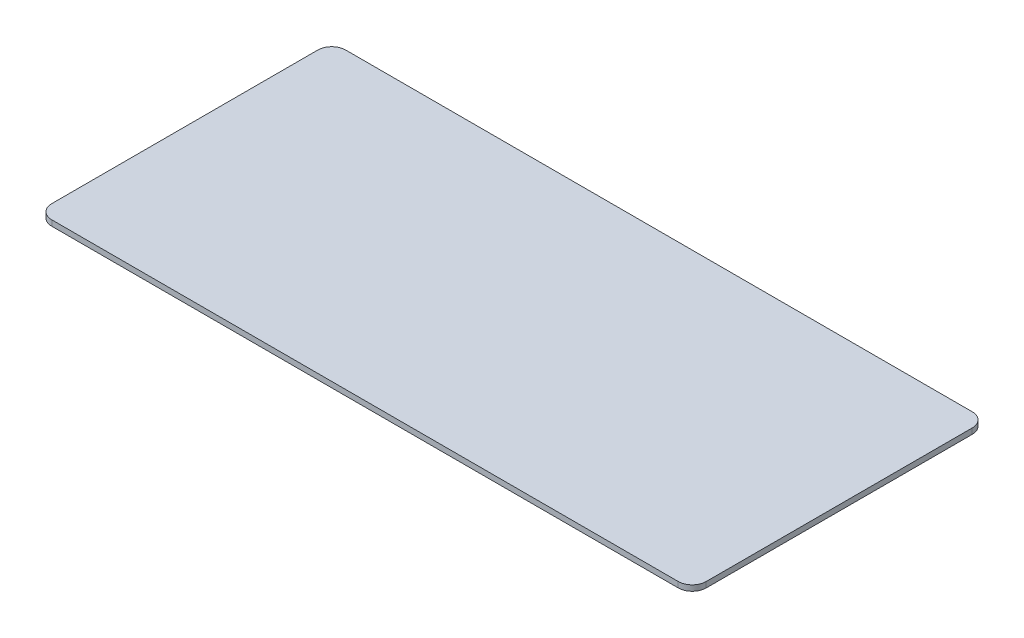
ISO-10303-21;
HEADER;
FILE_DESCRIPTION(('STEP AP214'),'2;1');
FILE_NAME('part.step','',(''),(''),'','','');
FILE_SCHEMA(('AUTOMOTIVE_DESIGN { 1 0 10303 214 1 1 1 1 }'));
ENDSEC;
DATA;
#1=APPLICATION_CONTEXT('core data for automotive mechanical design processes');
#2=APPLICATION_PROTOCOL_DEFINITION('international standard','automotive_design',2000,#1);
#3=PRODUCT_CONTEXT('',#1,'mechanical');
#4=PRODUCT('Part','Part','',(#3));
#5=PRODUCT_RELATED_PRODUCT_CATEGORY('part','',(#4));
#6=PRODUCT_DEFINITION_FORMATION('','',#4);
#7=PRODUCT_DEFINITION_CONTEXT('part definition',#1,'design');
#8=PRODUCT_DEFINITION('design','',#6,#7);
#9=PRODUCT_DEFINITION_SHAPE('','',#8);
#10=(LENGTH_UNIT() NAMED_UNIT(*) SI_UNIT(.MILLI.,.METRE.));
#11=(NAMED_UNIT(*) PLANE_ANGLE_UNIT() SI_UNIT($,.RADIAN.));
#12=(NAMED_UNIT(*) SI_UNIT($,.STERADIAN.) SOLID_ANGLE_UNIT());
#13=UNCERTAINTY_MEASURE_WITH_UNIT(LENGTH_MEASURE(1.E-05),#10,'distance_accuracy_value','');
#14=(GEOMETRIC_REPRESENTATION_CONTEXT(3) GLOBAL_UNCERTAINTY_ASSIGNED_CONTEXT((#13)) GLOBAL_UNIT_ASSIGNED_CONTEXT((#10,
#11,#12)) REPRESENTATION_CONTEXT('',''));
#15=CARTESIAN_POINT('',(0.,0.,0.));
#16=DIRECTION('',(0.,0.,1.));
#17=DIRECTION('',(1.,0.,0.));
#18=AXIS2_PLACEMENT_3D('',#15,#16,#17);
#19=CARTESIAN_POINT('',(18.1569082796088,0.8,33.0600891692419));
#20=DIRECTION('',(0.,-1.,0.));
#21=DIRECTION('',(0.,0.,-1.));
#22=AXIS2_PLACEMENT_3D('',#19,#20,#21);
#23=CYLINDRICAL_SURFACE('',#22,2.);
#24=CARTESIAN_POINT('',(18.1569082796088,0.,33.0600891692419));
#25=DIRECTION('',(0.,1.,0.));
#26=DIRECTION('',(0.,0.,1.));
#27=AXIS2_PLACEMENT_3D('',#24,#25,#26);
#28=CIRCLE('',#27,2.);
#29=CARTESIAN_POINT('',(18.1569082796088,0.,35.0600891692419));
#30=VERTEX_POINT('',#29);
#31=CARTESIAN_POINT('',(20.1569082796088,0.,33.0600891692418));
#32=VERTEX_POINT('',#31);
#33=EDGE_CURVE('E144',#30,#32,#28,.T.);
#34=ORIENTED_EDGE('',*,*,#33,.T.);
#35=DIRECTION('',(0.,-1.,0.));
#36=VECTOR('',#35,1.);
#37=CARTESIAN_POINT('',(20.1569082796088,0.8,33.0600891692418));
#38=LINE('',#37,#36);
#39=CARTESIAN_POINT('',(20.1569082796088,0.8,33.0600891692418));
#40=VERTEX_POINT('',#39);
#41=EDGE_CURVE('E11',#40,#32,#38,.T.);
#42=ORIENTED_EDGE('',*,*,#41,.F.);
#43=CARTESIAN_POINT('',(18.1569082796088,0.8,33.0600891692419));
#44=DIRECTION('',(0.,1.,0.));
#45=DIRECTION('',(0.,0.,1.));
#46=AXIS2_PLACEMENT_3D('',#43,#44,#45);
#47=CIRCLE('',#46,2.);
#48=CARTESIAN_POINT('',(18.1569082796088,0.8,35.0600891692419));
#49=VERTEX_POINT('',#48);
#50=EDGE_CURVE('E166',#49,#40,#47,.T.);
#51=ORIENTED_EDGE('',*,*,#50,.F.);
#52=DIRECTION('',(0.,-1.,0.));
#53=VECTOR('',#52,1.);
#54=CARTESIAN_POINT('',(18.1569082796088,0.8,35.0600891692419));
#55=LINE('',#54,#53);
#56=EDGE_CURVE('E140',#49,#30,#55,.T.);
#57=ORIENTED_EDGE('',*,*,#56,.T.);
#58=EDGE_LOOP('',(#34,#42,#51,#57));
#59=FACE_BOUND('',#58,.T.);
#60=ADVANCED_FACE('F43',(#59),#23,.T.);
#61=CARTESIAN_POINT('',(20.1569082796088,0.8,33.0600891692418));
#62=DIRECTION('',(-1.,0.,0.));
#63=DIRECTION('',(0.,0.,1.));
#64=AXIS2_PLACEMENT_3D('',#61,#62,#63);
#65=PLANE('',#64);
#66=DIRECTION('',(0.,0.,-1.));
#67=VECTOR('',#66,1.);
#68=CARTESIAN_POINT('',(20.1569082796088,0.,33.0600891692418));
#69=LINE('',#68,#67);
#70=CARTESIAN_POINT('',(20.1569082796088,0.,-4.93991083075813));
#71=VERTEX_POINT('',#70);
#72=EDGE_CURVE('E148',#32,#71,#69,.T.);
#73=ORIENTED_EDGE('',*,*,#72,.T.);
#74=DIRECTION('',(0.,-1.,0.));
#75=VECTOR('',#74,1.);
#76=CARTESIAN_POINT('',(20.1569082796088,0.8,-4.93991083075813));
#77=LINE('',#76,#75);
#78=CARTESIAN_POINT('',(20.1569082796088,0.8,-4.93991083075813));
#79=VERTEX_POINT('',#78);
#80=EDGE_CURVE('E52',#79,#71,#77,.T.);
#81=ORIENTED_EDGE('',*,*,#80,.F.);
#82=DIRECTION('',(0.,0.,-1.));
#83=VECTOR('',#82,1.);
#84=CARTESIAN_POINT('',(20.1569082796088,0.8,33.0600891692418));
#85=LINE('',#84,#83);
#86=EDGE_CURVE('E103',#40,#79,#85,.T.);
#87=ORIENTED_EDGE('',*,*,#86,.F.);
#88=ORIENTED_EDGE('',*,*,#41,.T.);
#89=EDGE_LOOP('',(#73,#81,#87,#88));
#90=FACE_BOUND('',#89,.T.);
#91=ADVANCED_FACE('F212',(#90),#65,.F.);
#92=CARTESIAN_POINT('',(18.1569082796088,0.8,-4.93991083075815));
#93=DIRECTION('',(0.,-1.,0.));
#94=DIRECTION('',(0.,0.,-1.));
#95=AXIS2_PLACEMENT_3D('',#92,#93,#94);
#96=CYLINDRICAL_SURFACE('',#95,2.);
#97=CARTESIAN_POINT('',(18.1569082796088,0.,-4.93991083075815));
#98=DIRECTION('',(0.,1.,0.));
#99=DIRECTION('',(0.,0.,-1.));
#100=AXIS2_PLACEMENT_3D('',#97,#98,#99);
#101=CIRCLE('',#100,2.);
#102=CARTESIAN_POINT('',(18.1569082796088,0.,-6.93991083075815));
#103=VERTEX_POINT('',#102);
#104=EDGE_CURVE('E151',#71,#103,#101,.T.);
#105=ORIENTED_EDGE('',*,*,#104,.T.);
#106=DIRECTION('',(0.,-1.,0.));
#107=VECTOR('',#106,1.);
#108=CARTESIAN_POINT('',(18.1569082796088,0.8,-6.93991083075815));
#109=LINE('',#108,#107);
#110=CARTESIAN_POINT('',(18.1569082796088,0.8,-6.93991083075815));
#111=VERTEX_POINT('',#110);
#112=EDGE_CURVE('E177',#111,#103,#109,.T.);
#113=ORIENTED_EDGE('',*,*,#112,.F.);
#114=CARTESIAN_POINT('',(18.1569082796088,0.8,-4.93991083075815));
#115=DIRECTION('',(0.,1.,0.));
#116=DIRECTION('',(0.,0.,-1.));
#117=AXIS2_PLACEMENT_3D('',#114,#115,#116);
#118=CIRCLE('',#117,2.);
#119=EDGE_CURVE('E187',#79,#111,#118,.T.);
#120=ORIENTED_EDGE('',*,*,#119,.F.);
#121=ORIENTED_EDGE('',*,*,#80,.T.);
#122=EDGE_LOOP('',(#105,#113,#120,#121));
#123=FACE_BOUND('',#122,.T.);
#124=ADVANCED_FACE('F185',(#123),#96,.T.);
#125=CARTESIAN_POINT('',(-71.3430917203912,0.8,-6.93991083075815));
#126=DIRECTION('',(0.,0.,1.));
#127=DIRECTION('',(1.,0.,0.));
#128=AXIS2_PLACEMENT_3D('',#125,#126,#127);
#129=PLANE('',#128);
#130=DIRECTION('',(-1.,0.,0.));
#131=VECTOR('',#130,1.);
#132=CARTESIAN_POINT('',(-71.3430917203912,0.,-6.93991083075815));
#133=LINE('',#132,#131);
#134=CARTESIAN_POINT('',(-71.3430917203912,0.,-6.93991083075815));
#135=VERTEX_POINT('',#134);
#136=EDGE_CURVE('E154',#103,#135,#133,.T.);
#137=ORIENTED_EDGE('',*,*,#136,.T.);
#138=DIRECTION('',(0.,-1.,0.));
#139=VECTOR('',#138,1.);
#140=CARTESIAN_POINT('',(-71.3430917203912,0.8,-6.93991083075815));
#141=LINE('',#140,#139);
#142=CARTESIAN_POINT('',(-71.3430917203912,0.8,-6.93991083075815));
#143=VERTEX_POINT('',#142);
#144=EDGE_CURVE('E173',#143,#135,#141,.T.);
#145=ORIENTED_EDGE('',*,*,#144,.F.);
#146=DIRECTION('',(-1.,0.,0.));
#147=VECTOR('',#146,1.);
#148=CARTESIAN_POINT('',(-71.3430917203912,0.8,-6.93991083075815));
#149=LINE('',#148,#147);
#150=EDGE_CURVE('E200',#111,#143,#149,.T.);
#151=ORIENTED_EDGE('',*,*,#150,.F.);
#152=ORIENTED_EDGE('',*,*,#112,.T.);
#153=EDGE_LOOP('',(#137,#145,#151,#152));
#154=FACE_BOUND('',#153,.T.);
#155=ADVANCED_FACE('F195',(#154),#129,.F.);
#156=CARTESIAN_POINT('',(-71.3430917203912,0.8,-4.93991083075815));
#157=DIRECTION('',(0.,-1.,0.));
#158=DIRECTION('',(0.,0.,-1.));
#159=AXIS2_PLACEMENT_3D('',#156,#157,#158);
#160=CYLINDRICAL_SURFACE('',#159,2.);
#161=CARTESIAN_POINT('',(-71.3430917203912,0.,-4.93991083075815));
#162=DIRECTION('',(0.,1.,0.));
#163=DIRECTION('',(0.,0.,-1.));
#164=AXIS2_PLACEMENT_3D('',#161,#162,#163);
#165=CIRCLE('',#164,2.);
#166=CARTESIAN_POINT('',(-73.3430917203912,0.,-4.93991083075813));
#167=VERTEX_POINT('',#166);
#168=EDGE_CURVE('E157',#135,#167,#165,.T.);
#169=ORIENTED_EDGE('',*,*,#168,.T.);
#170=DIRECTION('',(0.,-1.,0.));
#171=VECTOR('',#170,1.);
#172=CARTESIAN_POINT('',(-73.3430917203912,0.8,-4.93991083075813));
#173=LINE('',#172,#171);
#174=CARTESIAN_POINT('',(-73.3430917203912,0.8,-4.93991083075813));
#175=VERTEX_POINT('',#174);
#176=EDGE_CURVE('E133',#175,#167,#173,.T.);
#177=ORIENTED_EDGE('',*,*,#176,.F.);
#178=CARTESIAN_POINT('',(-71.3430917203912,0.8,-4.93991083075815));
#179=DIRECTION('',(0.,1.,0.));
#180=DIRECTION('',(0.,0.,-1.));
#181=AXIS2_PLACEMENT_3D('',#178,#179,#180);
#182=CIRCLE('',#181,2.);
#183=EDGE_CURVE('E122',#143,#175,#182,.T.);
#184=ORIENTED_EDGE('',*,*,#183,.F.);
#185=ORIENTED_EDGE('',*,*,#144,.T.);
#186=EDGE_LOOP('',(#169,#177,#184,#185));
#187=FACE_BOUND('',#186,.T.);
#188=ADVANCED_FACE('F198',(#187),#160,.T.);
#189=CARTESIAN_POINT('',(-73.3430917203912,0.8,33.0600891692418));
#190=DIRECTION('',(1.,0.,0.));
#191=DIRECTION('',(0.,0.,-1.));
#192=AXIS2_PLACEMENT_3D('',#189,#190,#191);
#193=PLANE('',#192);
#194=DIRECTION('',(0.,0.,1.));
#195=VECTOR('',#194,1.);
#196=CARTESIAN_POINT('',(-73.3430917203912,0.,33.0600891692418));
#197=LINE('',#196,#195);
#198=CARTESIAN_POINT('',(-73.3430917203912,0.,33.0600891692418));
#199=VERTEX_POINT('',#198);
#200=EDGE_CURVE('E131',#167,#199,#197,.T.);
#201=ORIENTED_EDGE('',*,*,#200,.T.);
#202=DIRECTION('',(0.,-1.,0.));
#203=VECTOR('',#202,1.);
#204=CARTESIAN_POINT('',(-73.3430917203912,0.8,33.0600891692418));
#205=LINE('',#204,#203);
#206=CARTESIAN_POINT('',(-73.3430917203912,0.8,33.0600891692418));
#207=VERTEX_POINT('',#206);
#208=EDGE_CURVE('E128',#207,#199,#205,.T.);
#209=ORIENTED_EDGE('',*,*,#208,.F.);
#210=DIRECTION('',(0.,0.,1.));
#211=VECTOR('',#210,1.);
#212=CARTESIAN_POINT('',(-73.3430917203912,0.8,33.0600891692418));
#213=LINE('',#212,#211);
#214=EDGE_CURVE('E116',#175,#207,#213,.T.);
#215=ORIENTED_EDGE('',*,*,#214,.F.);
#216=ORIENTED_EDGE('',*,*,#176,.T.);
#217=EDGE_LOOP('',(#201,#209,#215,#216));
#218=FACE_BOUND('',#217,.T.);
#219=ADVANCED_FACE('F129',(#218),#193,.F.);
#220=CARTESIAN_POINT('',(-71.3430917203912,0.8,33.0600891692419));
#221=DIRECTION('',(0.,-1.,0.));
#222=DIRECTION('',(0.,0.,-1.));
#223=AXIS2_PLACEMENT_3D('',#220,#221,#222);
#224=CYLINDRICAL_SURFACE('',#223,2.);
#225=CARTESIAN_POINT('',(-71.3430917203912,0.,33.0600891692419));
#226=DIRECTION('',(0.,1.,0.));
#227=DIRECTION('',(0.,0.,-1.));
#228=AXIS2_PLACEMENT_3D('',#225,#226,#227);
#229=CIRCLE('',#228,2.);
#230=CARTESIAN_POINT('',(-71.3430917203912,0.,35.0600891692419));
#231=VERTEX_POINT('',#230);
#232=EDGE_CURVE('E89',#199,#231,#229,.T.);
#233=ORIENTED_EDGE('',*,*,#232,.T.);
#234=DIRECTION('',(0.,-1.,0.));
#235=VECTOR('',#234,1.);
#236=CARTESIAN_POINT('',(-71.3430917203912,0.8,35.0600891692419));
#237=LINE('',#236,#235);
#238=CARTESIAN_POINT('',(-71.3430917203912,0.8,35.0600891692419));
#239=VERTEX_POINT('',#238);
#240=EDGE_CURVE('E134',#239,#231,#237,.T.);
#241=ORIENTED_EDGE('',*,*,#240,.F.);
#242=CARTESIAN_POINT('',(-71.3430917203912,0.8,33.0600891692419));
#243=DIRECTION('',(0.,1.,0.));
#244=DIRECTION('',(0.,0.,-1.));
#245=AXIS2_PLACEMENT_3D('',#242,#243,#244);
#246=CIRCLE('',#245,2.);
#247=EDGE_CURVE('E120',#207,#239,#246,.T.);
#248=ORIENTED_EDGE('',*,*,#247,.F.);
#249=ORIENTED_EDGE('',*,*,#208,.T.);
#250=EDGE_LOOP('',(#233,#241,#248,#249));
#251=FACE_BOUND('',#250,.T.);
#252=ADVANCED_FACE('F136',(#251),#224,.T.);
#253=CARTESIAN_POINT('',(-71.3430917203912,0.8,35.0600891692419));
#254=DIRECTION('',(0.,0.,-1.));
#255=DIRECTION('',(-1.,0.,0.));
#256=AXIS2_PLACEMENT_3D('',#253,#254,#255);
#257=PLANE('',#256);
#258=DIRECTION('',(1.,0.,0.));
#259=VECTOR('',#258,1.);
#260=CARTESIAN_POINT('',(-71.3430917203912,0.,35.0600891692419));
#261=LINE('',#260,#259);
#262=EDGE_CURVE('E95',#231,#30,#261,.T.);
#263=ORIENTED_EDGE('',*,*,#262,.T.);
#264=ORIENTED_EDGE('',*,*,#56,.F.);
#265=DIRECTION('',(1.,0.,0.));
#266=VECTOR('',#265,1.);
#267=CARTESIAN_POINT('',(-71.3430917203912,0.8,35.0600891692419));
#268=LINE('',#267,#266);
#269=EDGE_CURVE('E60',#239,#49,#268,.T.);
#270=ORIENTED_EDGE('',*,*,#269,.F.);
#271=ORIENTED_EDGE('',*,*,#240,.T.);
#272=EDGE_LOOP('',(#263,#264,#270,#271));
#273=FACE_BOUND('',#272,.T.);
#274=ADVANCED_FACE('F228',(#273),#257,.F.);
#275=CARTESIAN_POINT('',(18.1569082796088,0.8,33.0600891692419));
#276=DIRECTION('',(0.,1.,0.));
#277=DIRECTION('',(0.,0.,1.));
#278=AXIS2_PLACEMENT_3D('',#275,#276,#277);
#279=PLANE('',#278);
#280=ORIENTED_EDGE('',*,*,#50,.T.);
#281=ORIENTED_EDGE('',*,*,#86,.T.);
#282=ORIENTED_EDGE('',*,*,#119,.T.);
#283=ORIENTED_EDGE('',*,*,#150,.T.);
#284=ORIENTED_EDGE('',*,*,#183,.T.);
#285=ORIENTED_EDGE('',*,*,#214,.T.);
#286=ORIENTED_EDGE('',*,*,#247,.T.);
#287=ORIENTED_EDGE('',*,*,#269,.T.);
#288=EDGE_LOOP('',(#280,#281,#282,#283,#284,#285,#286,#287));
#289=FACE_BOUND('',#288,.T.);
#290=ADVANCED_FACE('F118',(#289),#279,.T.);
#291=CARTESIAN_POINT('',(18.1569082796088,0.,33.0600891692419));
#292=DIRECTION('',(0.,1.,0.));
#293=DIRECTION('',(0.,0.,1.));
#294=AXIS2_PLACEMENT_3D('',#291,#292,#293);
#295=PLANE('',#294);
#296=ORIENTED_EDGE('',*,*,#33,.F.);
#297=ORIENTED_EDGE('',*,*,#262,.F.);
#298=ORIENTED_EDGE('',*,*,#232,.F.);
#299=ORIENTED_EDGE('',*,*,#200,.F.);
#300=ORIENTED_EDGE('',*,*,#168,.F.);
#301=ORIENTED_EDGE('',*,*,#136,.F.);
#302=ORIENTED_EDGE('',*,*,#104,.F.);
#303=ORIENTED_EDGE('',*,*,#72,.F.);
#304=EDGE_LOOP('',(#296,#297,#298,#299,#300,#301,#302,#303));
#305=FACE_BOUND('',#304,.T.);
#306=ADVANCED_FACE('F191',(#305),#295,.F.);
#307=CLOSED_SHELL('',(#60,#91,#124,#155,#188,#219,#252,#274,#290,#306));
#308=MANIFOLD_SOLID_BREP('B2',#307);
#309=ADVANCED_BREP_SHAPE_REPRESENTATION('',(#18,#308),#14);
#310=SHAPE_DEFINITION_REPRESENTATION(#9,#309);
ENDSEC;
END-ISO-10303-21;
